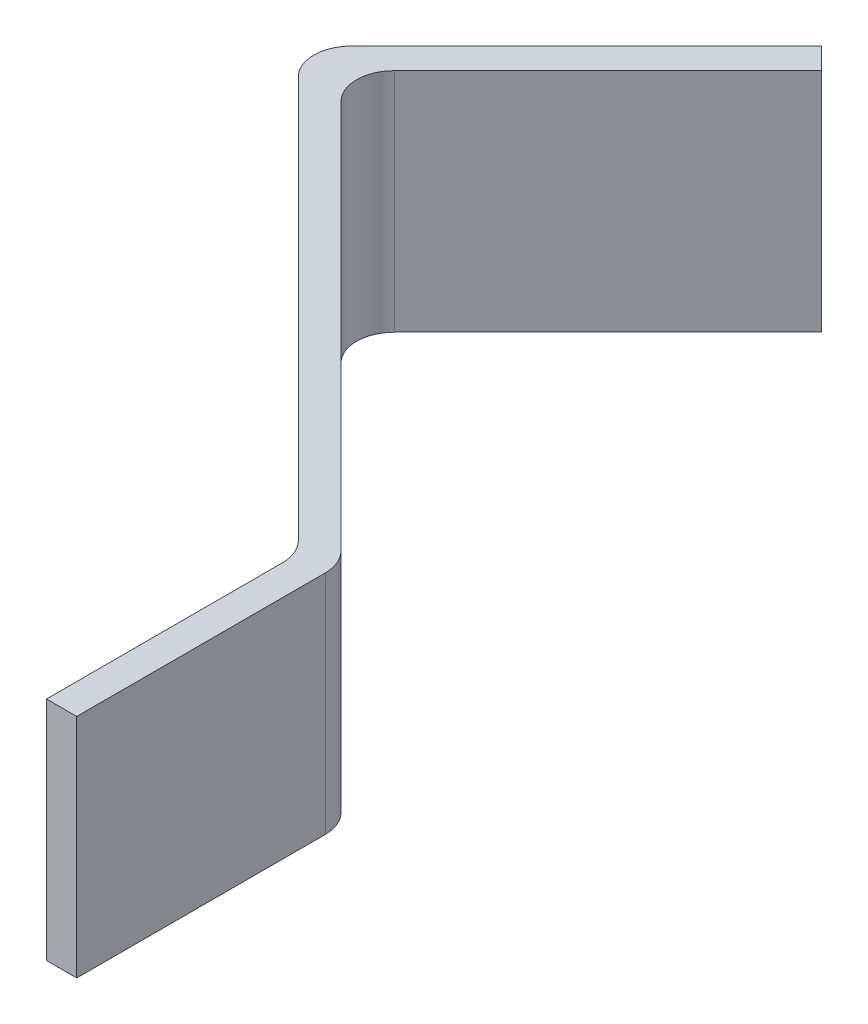
ISO-10303-21;
HEADER;
FILE_DESCRIPTION(('STEP AP214'),'2;1');
FILE_NAME('part.step','',(''),(''),'','','');
FILE_SCHEMA(('AUTOMOTIVE_DESIGN { 1 0 10303 214 1 1 1 1 }'));
ENDSEC;
DATA;
#1=APPLICATION_CONTEXT('core data for automotive mechanical design processes');
#2=APPLICATION_PROTOCOL_DEFINITION('international standard','automotive_design',2000,#1);
#3=PRODUCT_CONTEXT('',#1,'mechanical');
#4=PRODUCT('Part','Part','',(#3));
#5=PRODUCT_RELATED_PRODUCT_CATEGORY('part','',(#4));
#6=PRODUCT_DEFINITION_FORMATION('','',#4);
#7=PRODUCT_DEFINITION_CONTEXT('part definition',#1,'design');
#8=PRODUCT_DEFINITION('design','',#6,#7);
#9=PRODUCT_DEFINITION_SHAPE('','',#8);
#10=(LENGTH_UNIT() NAMED_UNIT(*) SI_UNIT(.MILLI.,.METRE.));
#11=(NAMED_UNIT(*) PLANE_ANGLE_UNIT() SI_UNIT($,.RADIAN.));
#12=(NAMED_UNIT(*) SI_UNIT($,.STERADIAN.) SOLID_ANGLE_UNIT());
#13=UNCERTAINTY_MEASURE_WITH_UNIT(LENGTH_MEASURE(1.E-05),#10,'distance_accuracy_value','');
#14=(GEOMETRIC_REPRESENTATION_CONTEXT(3) GLOBAL_UNCERTAINTY_ASSIGNED_CONTEXT((#13)) GLOBAL_UNIT_ASSIGNED_CONTEXT((#10,
#11,#12)) REPRESENTATION_CONTEXT('',''));
#15=CARTESIAN_POINT('',(0.,0.,0.));
#16=DIRECTION('',(0.,0.,1.));
#17=DIRECTION('',(1.,0.,0.));
#18=AXIS2_PLACEMENT_3D('',#15,#16,#17);
#19=CARTESIAN_POINT('',(-245.256587827419,-22.5,-468.225396744416));
#20=DIRECTION('',(0.,1.,0.));
#21=DIRECTION('',(0.,0.,1.));
#22=AXIS2_PLACEMENT_3D('',#19,#20,#21);
#23=CYLINDRICAL_SURFACE('',#22,4.99999999999998);
#24=CARTESIAN_POINT('',(-245.256587827419,7.5,-468.225396744416));
#25=DIRECTION('',(0.,1.,0.));
#26=DIRECTION('',(0.,0.,1.));
#27=AXIS2_PLACEMENT_3D('',#24,#25,#26);
#28=CIRCLE('',#27,4.99999999999998);
#29=CARTESIAN_POINT('',(-248.792121733351,7.5,-471.760930650349));
#30=VERTEX_POINT('',#29);
#31=CARTESIAN_POINT('',(-248.792121733351,7.5,-464.689862838483));
#32=VERTEX_POINT('',#31);
#33=EDGE_CURVE('E154',#30,#32,#28,.T.);
#34=ORIENTED_EDGE('',*,*,#33,.F.);
#35=DIRECTION('',(0.,1.,0.));
#36=VECTOR('',#35,1.);
#37=CARTESIAN_POINT('',(-248.792121733351,-22.5,-471.760930650349));
#38=LINE('',#37,#36);
#39=CARTESIAN_POINT('',(-248.792121733351,-22.5,-471.760930650349));
#40=VERTEX_POINT('',#39);
#41=EDGE_CURVE('E11',#40,#30,#38,.T.);
#42=ORIENTED_EDGE('',*,*,#41,.F.);
#43=CARTESIAN_POINT('',(-245.256587827419,-22.5,-468.225396744416));
#44=DIRECTION('',(0.,1.,0.));
#45=DIRECTION('',(0.,0.,1.));
#46=AXIS2_PLACEMENT_3D('',#43,#44,#45);
#47=CIRCLE('',#46,4.99999999999998);
#48=CARTESIAN_POINT('',(-248.792121733351,-22.5,-464.689862838483));
#49=VERTEX_POINT('',#48);
#50=EDGE_CURVE('E186',#40,#49,#47,.T.);
#51=ORIENTED_EDGE('',*,*,#50,.T.);
#52=DIRECTION('',(0.,1.,0.));
#53=VECTOR('',#52,1.);
#54=CARTESIAN_POINT('',(-248.792121733351,-22.5,-464.689862838483));
#55=LINE('',#54,#53);
#56=EDGE_CURVE('E36',#49,#32,#55,.T.);
#57=ORIENTED_EDGE('',*,*,#56,.T.);
#58=EDGE_LOOP('',(#34,#42,#51,#57));
#59=FACE_BOUND('',#58,.T.);
#60=ADVANCED_FACE('F33',(#59),#23,.T.);
#61=CARTESIAN_POINT('',(-217.679423361143,-22.5,-502.873629022557));
#62=DIRECTION('',(-0.70710678118655,0.,-0.707106781186545));
#63=DIRECTION('',(-0.707106781186545,0.,0.70710678118655));
#64=AXIS2_PLACEMENT_3D('',#61,#62,#63);
#65=PLANE('',#64);
#66=DIRECTION('',(-0.707106781186545,0.,0.70710678118655));
#67=VECTOR('',#66,1.);
#68=CARTESIAN_POINT('',(-217.679423361143,7.5,-502.873629022557));
#69=LINE('',#68,#67);
#70=CARTESIAN_POINT('',(-217.679423361143,7.5,-502.873629022557));
#71=VERTEX_POINT('',#70);
#72=EDGE_CURVE('E184',#71,#30,#69,.T.);
#73=ORIENTED_EDGE('',*,*,#72,.F.);
#74=DIRECTION('',(0.,1.,0.));
#75=VECTOR('',#74,1.);
#76=CARTESIAN_POINT('',(-217.679423361143,-22.5,-502.873629022557));
#77=LINE('',#76,#75);
#78=CARTESIAN_POINT('',(-217.679423361143,-22.5,-502.873629022557));
#79=VERTEX_POINT('',#78);
#80=EDGE_CURVE('E42',#79,#71,#77,.T.);
#81=ORIENTED_EDGE('',*,*,#80,.F.);
#82=DIRECTION('',(-0.707106781186545,0.,0.70710678118655));
#83=VECTOR('',#82,1.);
#84=CARTESIAN_POINT('',(-217.679423361143,-22.5,-502.873629022557));
#85=LINE('',#84,#83);
#86=EDGE_CURVE('E144',#79,#40,#85,.T.);
#87=ORIENTED_EDGE('',*,*,#86,.T.);
#88=ORIENTED_EDGE('',*,*,#41,.T.);
#89=EDGE_LOOP('',(#73,#81,#87,#88));
#90=FACE_BOUND('',#89,.T.);
#91=ADVANCED_FACE('F206',(#90),#65,.T.);
#92=CARTESIAN_POINT('',(-214.850996236397,-22.5,-500.04520189781));
#93=DIRECTION('',(0.707106781186655,0.,-0.70710678118644));
#94=DIRECTION('',(-0.70710678118644,0.,-0.707106781186655));
#95=AXIS2_PLACEMENT_3D('',#92,#93,#94);
#96=PLANE('',#95);
#97=DIRECTION('',(-0.70710678118644,0.,-0.707106781186655));
#98=VECTOR('',#97,1.);
#99=CARTESIAN_POINT('',(-214.850996236397,7.5,-500.04520189781));
#100=LINE('',#99,#98);
#101=CARTESIAN_POINT('',(-214.850996236397,7.5,-500.04520189781));
#102=VERTEX_POINT('',#101);
#103=EDGE_CURVE('E131',#102,#71,#100,.T.);
#104=ORIENTED_EDGE('',*,*,#103,.F.);
#105=DIRECTION('',(0.,1.,0.));
#106=VECTOR('',#105,1.);
#107=CARTESIAN_POINT('',(-214.850996236397,-22.5,-500.04520189781));
#108=LINE('',#107,#106);
#109=CARTESIAN_POINT('',(-214.850996236397,-22.5,-500.04520189781));
#110=VERTEX_POINT('',#109);
#111=EDGE_CURVE('E126',#110,#102,#108,.T.);
#112=ORIENTED_EDGE('',*,*,#111,.F.);
#113=DIRECTION('',(-0.70710678118644,0.,-0.707106781186655));
#114=VECTOR('',#113,1.);
#115=CARTESIAN_POINT('',(-214.850996236397,-22.5,-500.04520189781));
#116=LINE('',#115,#114);
#117=EDGE_CURVE('E129',#110,#79,#116,.T.);
#118=ORIENTED_EDGE('',*,*,#117,.T.);
#119=ORIENTED_EDGE('',*,*,#80,.T.);
#120=EDGE_LOOP('',(#104,#112,#118,#119));
#121=FACE_BOUND('',#120,.T.);
#122=ADVANCED_FACE('F128',(#121),#96,.T.);
#123=CARTESIAN_POINT('',(-243.135267483859,-22.5,-471.760930650349));
#124=DIRECTION('',(0.707106781186541,0.,0.707106781186554));
#125=DIRECTION('',(0.707106781186554,0.,-0.707106781186541));
#126=AXIS2_PLACEMENT_3D('',#123,#124,#125);
#127=PLANE('',#126);
#128=DIRECTION('',(0.707106781186554,0.,-0.707106781186541));
#129=VECTOR('',#128,1.);
#130=CARTESIAN_POINT('',(-243.135267483859,7.5,-471.760930650349));
#131=LINE('',#130,#129);
#132=CARTESIAN_POINT('',(-243.135267483859,7.5,-471.760930650349));
#133=VERTEX_POINT('',#132);
#134=EDGE_CURVE('E181',#133,#102,#131,.T.);
#135=ORIENTED_EDGE('',*,*,#134,.F.);
#136=DIRECTION('',(0.,1.,0.));
#137=VECTOR('',#136,1.);
#138=CARTESIAN_POINT('',(-243.135267483859,-22.5,-471.760930650349));
#139=LINE('',#138,#137);
#140=CARTESIAN_POINT('',(-243.135267483859,-22.5,-471.760930650349));
#141=VERTEX_POINT('',#140);
#142=EDGE_CURVE('E136',#141,#133,#139,.T.);
#143=ORIENTED_EDGE('',*,*,#142,.F.);
#144=DIRECTION('',(0.707106781186554,0.,-0.707106781186541));
#145=VECTOR('',#144,1.);
#146=CARTESIAN_POINT('',(-243.135267483859,-22.5,-471.760930650349));
#147=LINE('',#146,#145);
#148=EDGE_CURVE('E142',#141,#110,#147,.T.);
#149=ORIENTED_EDGE('',*,*,#148,.T.);
#150=ORIENTED_EDGE('',*,*,#111,.T.);
#151=EDGE_LOOP('',(#135,#143,#149,#150));
#152=FACE_BOUND('',#151,.T.);
#153=ADVANCED_FACE('F146',(#152),#127,.T.);
#154=CARTESIAN_POINT('',(-239.599733577926,-22.5,-468.225396744416));
#155=DIRECTION('',(0.,1.,0.));
#156=DIRECTION('',(0.,0.,1.));
#157=AXIS2_PLACEMENT_3D('',#154,#155,#156);
#158=CYLINDRICAL_SURFACE('',#157,4.99999999999997);
#159=CARTESIAN_POINT('',(-239.599733577926,7.5,-468.225396744416));
#160=DIRECTION('',(0.,-1.,0.));
#161=DIRECTION('',(0.,0.,1.));
#162=AXIS2_PLACEMENT_3D('',#159,#160,#161);
#163=CIRCLE('',#162,4.99999999999997);
#164=CARTESIAN_POINT('',(-243.135267483859,7.5,-464.689862838483));
#165=VERTEX_POINT('',#164);
#166=EDGE_CURVE('E178',#165,#133,#163,.T.);
#167=ORIENTED_EDGE('',*,*,#166,.F.);
#168=DIRECTION('',(0.,1.,0.));
#169=VECTOR('',#168,1.);
#170=CARTESIAN_POINT('',(-243.135267483859,-22.5,-464.689862838483));
#171=LINE('',#170,#169);
#172=CARTESIAN_POINT('',(-243.135267483859,-22.5,-464.689862838483));
#173=VERTEX_POINT('',#172);
#174=EDGE_CURVE('E190',#173,#165,#171,.T.);
#175=ORIENTED_EDGE('',*,*,#174,.F.);
#176=CARTESIAN_POINT('',(-239.599733577926,-22.5,-468.225396744416));
#177=DIRECTION('',(0.,-1.,0.));
#178=DIRECTION('',(0.,0.,1.));
#179=AXIS2_PLACEMENT_3D('',#176,#177,#178);
#180=CIRCLE('',#179,4.99999999999997);
#181=EDGE_CURVE('E147',#173,#141,#180,.T.);
#182=ORIENTED_EDGE('',*,*,#181,.T.);
#183=ORIENTED_EDGE('',*,*,#142,.T.);
#184=EDGE_LOOP('',(#167,#175,#182,#183));
#185=FACE_BOUND('',#184,.T.);
#186=ADVANCED_FACE('F219',(#185),#158,.F.);
#187=CARTESIAN_POINT('',(-191.566724988935,-22.5,-413.121320343559));
#188=DIRECTION('',(0.707106781186549,0.,-0.707106781186546));
#189=DIRECTION('',(-0.707106781186546,0.,-0.707106781186549));
#190=AXIS2_PLACEMENT_3D('',#187,#188,#189);
#191=PLANE('',#190);
#192=DIRECTION('',(-0.707106781186546,0.,-0.707106781186549));
#193=VECTOR('',#192,1.);
#194=CARTESIAN_POINT('',(-191.566724988935,7.5,-413.121320343559));
#195=LINE('',#194,#193);
#196=CARTESIAN_POINT('',(-191.566724988935,7.5,-413.121320343559));
#197=VERTEX_POINT('',#196);
#198=EDGE_CURVE('E175',#197,#165,#195,.T.);
#199=ORIENTED_EDGE('',*,*,#198,.F.);
#200=DIRECTION('',(0.,1.,0.));
#201=VECTOR('',#200,1.);
#202=CARTESIAN_POINT('',(-191.566724988935,-22.5,-413.121320343559));
#203=LINE('',#202,#201);
#204=CARTESIAN_POINT('',(-191.566724988935,-22.5,-413.121320343559));
#205=VERTEX_POINT('',#204);
#206=EDGE_CURVE('E192',#205,#197,#203,.T.);
#207=ORIENTED_EDGE('',*,*,#206,.F.);
#208=DIRECTION('',(-0.707106781186546,0.,-0.707106781186549));
#209=VECTOR('',#208,1.);
#210=CARTESIAN_POINT('',(-191.566724988935,-22.5,-413.121320343559));
#211=LINE('',#210,#209);
#212=EDGE_CURVE('E149',#205,#173,#211,.T.);
#213=ORIENTED_EDGE('',*,*,#212,.T.);
#214=ORIENTED_EDGE('',*,*,#174,.T.);
#215=EDGE_LOOP('',(#199,#207,#213,#214));
#216=FACE_BOUND('',#215,.T.);
#217=ADVANCED_FACE('F222',(#216),#191,.T.);
#218=CARTESIAN_POINT('',(-195.102258894868,-22.5,-409.585786437627));
#219=DIRECTION('',(0.,1.,0.));
#220=DIRECTION('',(0.,0.,1.));
#221=AXIS2_PLACEMENT_3D('',#218,#219,#220);
#222=CYLINDRICAL_SURFACE('',#221,5.00000000000001);
#223=CARTESIAN_POINT('',(-195.102258894868,7.5,-409.585786437627));
#224=DIRECTION('',(0.,1.,0.));
#225=DIRECTION('',(0.,0.,1.));
#226=AXIS2_PLACEMENT_3D('',#223,#224,#225);
#227=CIRCLE('',#226,5.00000000000001);
#228=CARTESIAN_POINT('',(-190.102258894868,7.5,-409.585786437627));
#229=VERTEX_POINT('',#228);
#230=EDGE_CURVE('E172',#229,#197,#227,.T.);
#231=ORIENTED_EDGE('',*,*,#230,.F.);
#232=DIRECTION('',(0.,1.,0.));
#233=VECTOR('',#232,1.);
#234=CARTESIAN_POINT('',(-190.102258894868,-22.5,-409.585786437627));
#235=LINE('',#234,#233);
#236=CARTESIAN_POINT('',(-190.102258894868,-22.5,-409.585786437627));
#237=VERTEX_POINT('',#236);
#238=EDGE_CURVE('E194',#237,#229,#235,.T.);
#239=ORIENTED_EDGE('',*,*,#238,.F.);
#240=CARTESIAN_POINT('',(-195.102258894868,-22.5,-409.585786437627));
#241=DIRECTION('',(0.,1.,0.));
#242=DIRECTION('',(0.,0.,1.));
#243=AXIS2_PLACEMENT_3D('',#240,#241,#242);
#244=CIRCLE('',#243,5.00000000000001);
#245=EDGE_CURVE('E348',#237,#205,#244,.T.);
#246=ORIENTED_EDGE('',*,*,#245,.T.);
#247=ORIENTED_EDGE('',*,*,#206,.T.);
#248=EDGE_LOOP('',(#231,#239,#246,#247));
#249=FACE_BOUND('',#248,.T.);
#250=ADVANCED_FACE('F226',(#249),#222,.T.);
#251=CARTESIAN_POINT('',(-190.102258894868,-22.5,-376.656854249492));
#252=DIRECTION('',(1.,0.,0.));
#253=DIRECTION('',(0.,0.,-1.));
#254=AXIS2_PLACEMENT_3D('',#251,#252,#253);
#255=PLANE('',#254);
#256=DIRECTION('',(0.,0.,-1.));
#257=VECTOR('',#256,1.);
#258=CARTESIAN_POINT('',(-190.102258894868,7.5,-376.656854249492));
#259=LINE('',#258,#257);
#260=CARTESIAN_POINT('',(-190.102258894868,7.5,-376.656854249492));
#261=VERTEX_POINT('',#260);
#262=EDGE_CURVE('E169',#261,#229,#259,.T.);
#263=ORIENTED_EDGE('',*,*,#262,.F.);
#264=DIRECTION('',(0.,1.,0.));
#265=VECTOR('',#264,1.);
#266=CARTESIAN_POINT('',(-190.102258894868,-22.5,-376.656854249492));
#267=LINE('',#266,#265);
#268=CARTESIAN_POINT('',(-190.102258894868,-22.5,-376.656854249492));
#269=VERTEX_POINT('',#268);
#270=EDGE_CURVE('E196',#269,#261,#267,.T.);
#271=ORIENTED_EDGE('',*,*,#270,.F.);
#272=DIRECTION('',(0.,0.,-1.));
#273=VECTOR('',#272,1.);
#274=CARTESIAN_POINT('',(-190.102258894868,-22.5,-376.656854249492));
#275=LINE('',#274,#273);
#276=EDGE_CURVE('E352',#269,#237,#275,.T.);
#277=ORIENTED_EDGE('',*,*,#276,.T.);
#278=ORIENTED_EDGE('',*,*,#238,.T.);
#279=EDGE_LOOP('',(#263,#271,#277,#278));
#280=FACE_BOUND('',#279,.T.);
#281=ADVANCED_FACE('F230',(#280),#255,.T.);
#282=CARTESIAN_POINT('',(-194.102258894868,-22.5,-376.656854249492));
#283=DIRECTION('',(0.,0.,1.));
#284=DIRECTION('',(1.,0.,0.));
#285=AXIS2_PLACEMENT_3D('',#282,#283,#284);
#286=PLANE('',#285);
#287=DIRECTION('',(1.,0.,0.));
#288=VECTOR('',#287,1.);
#289=CARTESIAN_POINT('',(-194.102258894868,7.5,-376.656854249492));
#290=LINE('',#289,#288);
#291=CARTESIAN_POINT('',(-194.102258894868,7.5,-376.656854249492));
#292=VERTEX_POINT('',#291);
#293=EDGE_CURVE('E166',#292,#261,#290,.T.);
#294=ORIENTED_EDGE('',*,*,#293,.F.);
#295=DIRECTION('',(0.,1.,0.));
#296=VECTOR('',#295,1.);
#297=CARTESIAN_POINT('',(-194.102258894868,-22.5,-376.656854249492));
#298=LINE('',#297,#296);
#299=CARTESIAN_POINT('',(-194.102258894868,-22.5,-376.656854249492));
#300=VERTEX_POINT('',#299);
#301=EDGE_CURVE('E198',#300,#292,#298,.T.);
#302=ORIENTED_EDGE('',*,*,#301,.F.);
#303=DIRECTION('',(1.,0.,0.));
#304=VECTOR('',#303,1.);
#305=CARTESIAN_POINT('',(-194.102258894868,-22.5,-376.656854249492));
#306=LINE('',#305,#304);
#307=EDGE_CURVE('E341',#300,#269,#306,.T.);
#308=ORIENTED_EDGE('',*,*,#307,.T.);
#309=ORIENTED_EDGE('',*,*,#270,.T.);
#310=EDGE_LOOP('',(#294,#302,#308,#309));
#311=FACE_BOUND('',#310,.T.);
#312=ADVANCED_FACE('F234',(#311),#286,.T.);
#313=CARTESIAN_POINT('',(-194.102258894868,-22.5,-407.928932188134));
#314=DIRECTION('',(-1.,0.,0.));
#315=DIRECTION('',(0.,0.,1.));
#316=AXIS2_PLACEMENT_3D('',#313,#314,#315);
#317=PLANE('',#316);
#318=DIRECTION('',(0.,0.,1.));
#319=VECTOR('',#318,1.);
#320=CARTESIAN_POINT('',(-194.102258894868,7.5,-407.928932188134));
#321=LINE('',#320,#319);
#322=CARTESIAN_POINT('',(-194.102258894868,7.5,-407.928932188134));
#323=VERTEX_POINT('',#322);
#324=EDGE_CURVE('E163',#323,#292,#321,.T.);
#325=ORIENTED_EDGE('',*,*,#324,.F.);
#326=DIRECTION('',(0.,1.,0.));
#327=VECTOR('',#326,1.);
#328=CARTESIAN_POINT('',(-194.102258894868,-22.5,-407.928932188134));
#329=LINE('',#328,#327);
#330=CARTESIAN_POINT('',(-194.102258894868,-22.5,-407.928932188134));
#331=VERTEX_POINT('',#330);
#332=EDGE_CURVE('E200',#331,#323,#329,.T.);
#333=ORIENTED_EDGE('',*,*,#332,.F.);
#334=DIRECTION('',(0.,0.,1.));
#335=VECTOR('',#334,1.);
#336=CARTESIAN_POINT('',(-194.102258894868,-22.5,-407.928932188134));
#337=LINE('',#336,#335);
#338=EDGE_CURVE('E337',#331,#300,#337,.T.);
#339=ORIENTED_EDGE('',*,*,#338,.T.);
#340=ORIENTED_EDGE('',*,*,#301,.T.);
#341=EDGE_LOOP('',(#325,#333,#339,#340));
#342=FACE_BOUND('',#341,.T.);
#343=ADVANCED_FACE('F238',(#342),#317,.T.);
#344=CARTESIAN_POINT('',(-199.102258894868,-22.5,-407.928932188134));
#345=DIRECTION('',(0.,1.,0.));
#346=DIRECTION('',(0.,0.,1.));
#347=AXIS2_PLACEMENT_3D('',#344,#345,#346);
#348=CYLINDRICAL_SURFACE('',#347,5.00000000000001);
#349=CARTESIAN_POINT('',(-199.102258894868,7.5,-407.928932188134));
#350=DIRECTION('',(0.,-1.,0.));
#351=DIRECTION('',(0.,0.,1.));
#352=AXIS2_PLACEMENT_3D('',#349,#350,#351);
#353=CIRCLE('',#352,5.00000000000001);
#354=CARTESIAN_POINT('',(-195.566724988935,7.5,-411.464466094067));
#355=VERTEX_POINT('',#354);
#356=EDGE_CURVE('E160',#355,#323,#353,.T.);
#357=ORIENTED_EDGE('',*,*,#356,.F.);
#358=DIRECTION('',(0.,1.,0.));
#359=VECTOR('',#358,1.);
#360=CARTESIAN_POINT('',(-195.566724988935,-22.5,-411.464466094067));
#361=LINE('',#360,#359);
#362=CARTESIAN_POINT('',(-195.566724988935,-22.5,-411.464466094067));
#363=VERTEX_POINT('',#362);
#364=EDGE_CURVE('E201',#363,#355,#361,.T.);
#365=ORIENTED_EDGE('',*,*,#364,.F.);
#366=CARTESIAN_POINT('',(-199.102258894868,-22.5,-407.928932188134));
#367=DIRECTION('',(0.,-1.,0.));
#368=DIRECTION('',(0.,0.,1.));
#369=AXIS2_PLACEMENT_3D('',#366,#367,#368);
#370=CIRCLE('',#369,5.00000000000001);
#371=EDGE_CURVE('E358',#363,#331,#370,.T.);
#372=ORIENTED_EDGE('',*,*,#371,.T.);
#373=ORIENTED_EDGE('',*,*,#332,.T.);
#374=EDGE_LOOP('',(#357,#365,#372,#373));
#375=FACE_BOUND('',#374,.T.);
#376=ADVANCED_FACE('F242',(#375),#348,.F.);
#377=CARTESIAN_POINT('',(-248.792121733351,-22.5,-464.689862838483));
#378=DIRECTION('',(-0.707106781186549,0.,0.707106781186546));
#379=DIRECTION('',(0.707106781186546,0.,0.707106781186549));
#380=AXIS2_PLACEMENT_3D('',#377,#378,#379);
#381=PLANE('',#380);
#382=DIRECTION('',(0.707106781186546,0.,0.707106781186549));
#383=VECTOR('',#382,1.);
#384=CARTESIAN_POINT('',(-248.792121733351,7.5,-464.689862838483));
#385=LINE('',#384,#383);
#386=EDGE_CURVE('E157',#32,#355,#385,.T.);
#387=ORIENTED_EDGE('',*,*,#386,.F.);
#388=ORIENTED_EDGE('',*,*,#56,.F.);
#389=DIRECTION('',(0.707106781186546,0.,0.707106781186549));
#390=VECTOR('',#389,1.);
#391=CARTESIAN_POINT('',(-248.792121733351,-22.5,-464.689862838483));
#392=LINE('',#391,#390);
#393=EDGE_CURVE('E360',#49,#363,#392,.T.);
#394=ORIENTED_EDGE('',*,*,#393,.T.);
#395=ORIENTED_EDGE('',*,*,#364,.T.);
#396=EDGE_LOOP('',(#387,#388,#394,#395));
#397=FACE_BOUND('',#396,.T.);
#398=ADVANCED_FACE('F203',(#397),#381,.T.);
#399=CARTESIAN_POINT('',(-245.256587827419,-22.5,-468.225396744416));
#400=DIRECTION('',(0.,1.,0.));
#401=DIRECTION('',(0.,0.,1.));
#402=AXIS2_PLACEMENT_3D('',#399,#400,#401);
#403=PLANE('',#402);
#404=ORIENTED_EDGE('',*,*,#50,.F.);
#405=ORIENTED_EDGE('',*,*,#86,.F.);
#406=ORIENTED_EDGE('',*,*,#117,.F.);
#407=ORIENTED_EDGE('',*,*,#148,.F.);
#408=ORIENTED_EDGE('',*,*,#181,.F.);
#409=ORIENTED_EDGE('',*,*,#212,.F.);
#410=ORIENTED_EDGE('',*,*,#245,.F.);
#411=ORIENTED_EDGE('',*,*,#276,.F.);
#412=ORIENTED_EDGE('',*,*,#307,.F.);
#413=ORIENTED_EDGE('',*,*,#338,.F.);
#414=ORIENTED_EDGE('',*,*,#371,.F.);
#415=ORIENTED_EDGE('',*,*,#393,.F.);
#416=EDGE_LOOP('',(#404,#405,#406,#407,#408,#409,#410,#411,#412,#413,#414,#415));
#417=FACE_BOUND('',#416,.T.);
#418=ADVANCED_FACE('F140',(#417),#403,.F.);
#419=CARTESIAN_POINT('',(-245.256587827419,7.5,-468.225396744416));
#420=DIRECTION('',(0.,1.,0.));
#421=DIRECTION('',(0.,0.,1.));
#422=AXIS2_PLACEMENT_3D('',#419,#420,#421);
#423=PLANE('',#422);
#424=ORIENTED_EDGE('',*,*,#33,.T.);
#425=ORIENTED_EDGE('',*,*,#386,.T.);
#426=ORIENTED_EDGE('',*,*,#356,.T.);
#427=ORIENTED_EDGE('',*,*,#324,.T.);
#428=ORIENTED_EDGE('',*,*,#293,.T.);
#429=ORIENTED_EDGE('',*,*,#262,.T.);
#430=ORIENTED_EDGE('',*,*,#230,.T.);
#431=ORIENTED_EDGE('',*,*,#198,.T.);
#432=ORIENTED_EDGE('',*,*,#166,.T.);
#433=ORIENTED_EDGE('',*,*,#134,.T.);
#434=ORIENTED_EDGE('',*,*,#103,.T.);
#435=ORIENTED_EDGE('',*,*,#72,.T.);
#436=EDGE_LOOP('',(#424,#425,#426,#427,#428,#429,#430,#431,#432,#433,#434,#435));
#437=FACE_BOUND('',#436,.T.);
#438=ADVANCED_FACE('F205',(#437),#423,.T.);
#439=CLOSED_SHELL('',(#60,#91,#122,#153,#186,#217,#250,#281,#312,#343,#376,#398,#418,#438));
#440=MANIFOLD_SOLID_BREP('B2',#439);
#441=ADVANCED_BREP_SHAPE_REPRESENTATION('',(#18,#440),#14);
#442=SHAPE_DEFINITION_REPRESENTATION(#9,#441);
ENDSEC;
END-ISO-10303-21;
